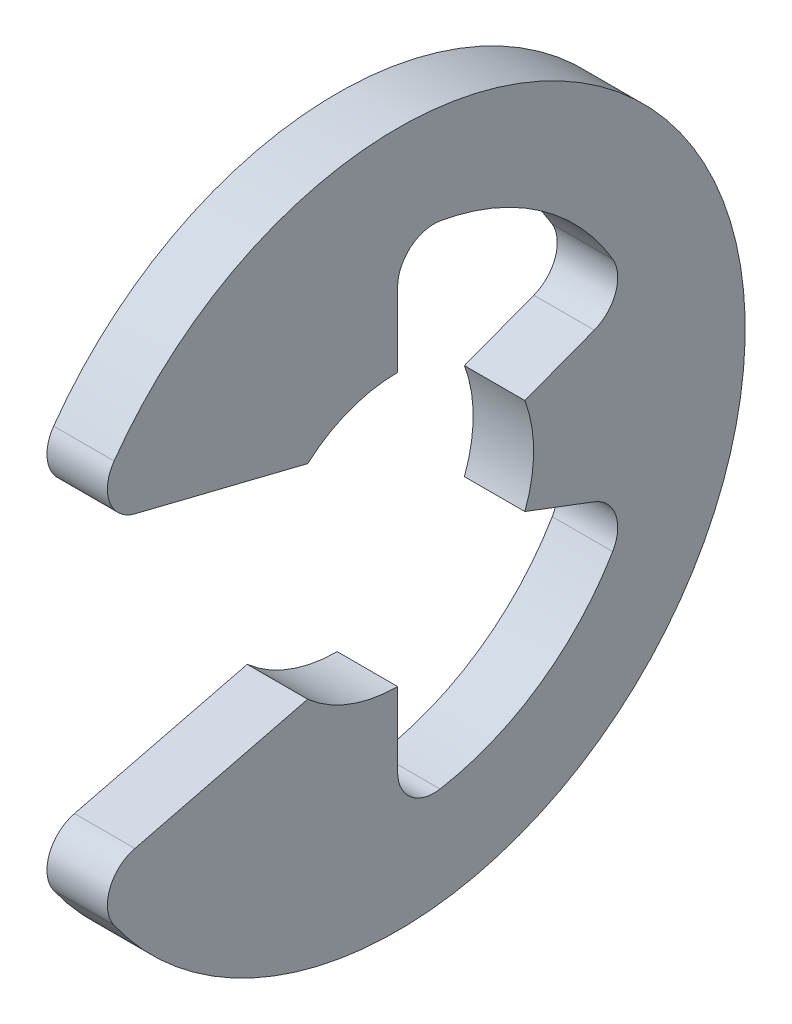
ISO-10303-21;
HEADER;
FILE_DESCRIPTION(('STEP AP214'),'2;1');
FILE_NAME('part.step','',(''),(''),'','','');
FILE_SCHEMA(('AUTOMOTIVE_DESIGN { 1 0 10303 214 1 1 1 1 }'));
ENDSEC;
DATA;
#1=APPLICATION_CONTEXT('core data for automotive mechanical design processes');
#2=APPLICATION_PROTOCOL_DEFINITION('international standard','automotive_design',2000,#1);
#3=PRODUCT_CONTEXT('',#1,'mechanical');
#4=PRODUCT('Part','Part','',(#3));
#5=PRODUCT_RELATED_PRODUCT_CATEGORY('part','',(#4));
#6=PRODUCT_DEFINITION_FORMATION('','',#4);
#7=PRODUCT_DEFINITION_CONTEXT('part definition',#1,'design');
#8=PRODUCT_DEFINITION('design','',#6,#7);
#9=PRODUCT_DEFINITION_SHAPE('','',#8);
#10=(LENGTH_UNIT() NAMED_UNIT(*) SI_UNIT(.MILLI.,.METRE.));
#11=(NAMED_UNIT(*) PLANE_ANGLE_UNIT() SI_UNIT($,.RADIAN.));
#12=(NAMED_UNIT(*) SI_UNIT($,.STERADIAN.) SOLID_ANGLE_UNIT());
#13=UNCERTAINTY_MEASURE_WITH_UNIT(LENGTH_MEASURE(1.E-05),#10,'distance_accuracy_value','');
#14=(GEOMETRIC_REPRESENTATION_CONTEXT(3) GLOBAL_UNCERTAINTY_ASSIGNED_CONTEXT((#13)) GLOBAL_UNIT_ASSIGNED_CONTEXT((#10,
#11,#12)) REPRESENTATION_CONTEXT('',''));
#15=CARTESIAN_POINT('',(0.,0.,0.));
#16=DIRECTION('',(0.,0.,1.));
#17=DIRECTION('',(1.,0.,0.));
#18=AXIS2_PLACEMENT_3D('',#15,#16,#17);
#19=CARTESIAN_POINT('',(0.3,0.,0.));
#20=DIRECTION('',(-1.,0.,0.));
#21=DIRECTION('',(0.,0.,1.));
#22=AXIS2_PLACEMENT_3D('',#19,#20,#21);
#23=CYLINDRICAL_SURFACE('',#22,3.45);
#24=CARTESIAN_POINT('',(0.3,0.,0.));
#25=DIRECTION('',(1.,0.,0.));
#26=DIRECTION('',(0.,0.,-1.));
#27=AXIS2_PLACEMENT_3D('',#24,#25,#26);
#28=CIRCLE('',#27,3.45);
#29=CARTESIAN_POINT('',(0.3,-1.99575242284903,2.8141556933994));
#30=VERTEX_POINT('',#29);
#31=CARTESIAN_POINT('',(0.3,1.99575242284903,2.8141556933994));
#32=VERTEX_POINT('',#31);
#33=EDGE_CURVE('E172',#30,#32,#28,.T.);
#34=ORIENTED_EDGE('',*,*,#33,.F.);
#35=DIRECTION('',(-1.,0.,0.));
#36=VECTOR('',#35,1.);
#37=CARTESIAN_POINT('',(0.3,-1.99575242284903,2.8141556933994));
#38=LINE('',#37,#36);
#39=CARTESIAN_POINT('',(-0.3,-1.99575242284903,2.8141556933994));
#40=VERTEX_POINT('',#39);
#41=EDGE_CURVE('E266',#30,#40,#38,.T.);
#42=ORIENTED_EDGE('',*,*,#41,.T.);
#43=CARTESIAN_POINT('',(-0.3,0.,0.));
#44=DIRECTION('',(1.,0.,0.));
#45=DIRECTION('',(0.,0.,-1.));
#46=AXIS2_PLACEMENT_3D('',#43,#44,#45);
#47=CIRCLE('',#46,3.45);
#48=CARTESIAN_POINT('',(-0.3,1.99575242284903,2.8141556933994));
#49=VERTEX_POINT('',#48);
#50=EDGE_CURVE('E210',#40,#49,#47,.T.);
#51=ORIENTED_EDGE('',*,*,#50,.T.);
#52=DIRECTION('',(-1.,0.,0.));
#53=VECTOR('',#52,1.);
#54=CARTESIAN_POINT('',(0.3,1.99575242284903,2.8141556933994));
#55=LINE('',#54,#53);
#56=EDGE_CURVE('E264',#49,#32,#55,.F.);
#57=ORIENTED_EDGE('',*,*,#56,.T.);
#58=EDGE_LOOP('',(#34,#42,#51,#57));
#59=FACE_BOUND('',#58,.T.);
#60=ADVANCED_FACE('F34',(#59),#23,.T.);
#61=CARTESIAN_POINT('',(0.3,1.55535385551941,3.07950878942095));
#62=DIRECTION('',(0.,0.970536829925373,-0.240952820606871));
#63=DIRECTION('',(0.,0.240952820606871,0.970536829925373));
#64=AXIS2_PLACEMENT_3D('',#61,#62,#63);
#65=PLANE('',#64);
#66=DIRECTION('',(0.,-0.240952820606871,-0.970536829925373));
#67=VECTOR('',#66,1.);
#68=CARTESIAN_POINT('',(0.3,1.55535385551941,3.07950878942095));
#69=LINE('',#68,#67);
#70=CARTESIAN_POINT('',(0.3,1.43810673734382,2.60724767994141));
#71=VERTEX_POINT('',#70);
#72=CARTESIAN_POINT('',(0.3,1.0125,0.8929410674843));
#73=VERTEX_POINT('',#72);
#74=EDGE_CURVE('E158',#71,#73,#69,.T.);
#75=ORIENTED_EDGE('',*,*,#74,.F.);
#76=DIRECTION('',(-1.,0.,0.));
#77=VECTOR('',#76,1.);
#78=CARTESIAN_POINT('',(0.3,1.43810673734382,2.60724767994141));
#79=LINE('',#78,#77);
#80=CARTESIAN_POINT('',(-0.3,1.43810673734382,2.60724767994141));
#81=VERTEX_POINT('',#80);
#82=EDGE_CURVE('E278',#71,#81,#79,.T.);
#83=ORIENTED_EDGE('',*,*,#82,.T.);
#84=DIRECTION('',(0.,-0.240952820606871,-0.970536829925373));
#85=VECTOR('',#84,1.);
#86=CARTESIAN_POINT('',(-0.3,1.55535385551941,3.07950878942095));
#87=LINE('',#86,#85);
#88=CARTESIAN_POINT('',(-0.3,1.0125,0.8929410674843));
#89=VERTEX_POINT('',#88);
#90=EDGE_CURVE('E178',#81,#89,#87,.T.);
#91=ORIENTED_EDGE('',*,*,#90,.T.);
#92=DIRECTION('',(-1.,0.,0.));
#93=VECTOR('',#92,1.);
#94=CARTESIAN_POINT('',(0.3,1.0125,0.8929410674843));
#95=LINE('',#94,#93);
#96=EDGE_CURVE('E175',#73,#89,#95,.T.);
#97=ORIENTED_EDGE('',*,*,#96,.F.);
#98=EDGE_LOOP('',(#75,#83,#91,#97));
#99=FACE_BOUND('',#98,.T.);
#100=ADVANCED_FACE('F176',(#99),#65,.F.);
#101=CARTESIAN_POINT('',(0.3,0.,0.));
#102=DIRECTION('',(-1.,0.,0.));
#103=DIRECTION('',(0.,0.,1.));
#104=AXIS2_PLACEMENT_3D('',#101,#102,#103);
#105=CYLINDRICAL_SURFACE('',#104,1.35);
#106=CARTESIAN_POINT('',(-0.3,0.,0.));
#107=DIRECTION('',(-1.,0.,0.));
#108=DIRECTION('',(0.,0.,1.));
#109=AXIS2_PLACEMENT_3D('',#106,#107,#108);
#110=CIRCLE('',#109,1.35);
#111=CARTESIAN_POINT('',(-0.3,1.35,0.));
#112=VERTEX_POINT('',#111);
#113=EDGE_CURVE('E214',#89,#112,#110,.T.);
#114=ORIENTED_EDGE('',*,*,#113,.T.);
#115=DIRECTION('',(-1.,0.,0.));
#116=VECTOR('',#115,1.);
#117=CARTESIAN_POINT('',(0.3,1.35,0.));
#118=LINE('',#117,#116);
#119=CARTESIAN_POINT('',(0.3,1.35,0.));
#120=VERTEX_POINT('',#119);
#121=EDGE_CURVE('E182',#120,#112,#118,.T.);
#122=ORIENTED_EDGE('',*,*,#121,.F.);
#123=CARTESIAN_POINT('',(0.3,0.,0.));
#124=DIRECTION('',(-1.,0.,0.));
#125=DIRECTION('',(0.,0.,1.));
#126=AXIS2_PLACEMENT_3D('',#123,#124,#125);
#127=CIRCLE('',#126,1.35);
#128=EDGE_CURVE('E164',#73,#120,#127,.T.);
#129=ORIENTED_EDGE('',*,*,#128,.F.);
#130=ORIENTED_EDGE('',*,*,#96,.T.);
#131=EDGE_LOOP('',(#114,#122,#129,#130));
#132=FACE_BOUND('',#131,.T.);
#133=ADVANCED_FACE('F184',(#132),#105,.F.);
#134=CARTESIAN_POINT('',(0.3,1.35,0.));
#135=DIRECTION('',(0.,0.,1.));
#136=DIRECTION('',(0.,-1.,0.));
#137=AXIS2_PLACEMENT_3D('',#134,#135,#136);
#138=PLANE('',#137);
#139=DIRECTION('',(0.,1.,0.));
#140=VECTOR('',#139,1.);
#141=CARTESIAN_POINT('',(-0.3,1.35,0.));
#142=LINE('',#141,#140);
#143=CARTESIAN_POINT('',(-0.3,2.08659165249111,0.));
#144=VERTEX_POINT('',#143);
#145=EDGE_CURVE('E216',#112,#144,#142,.T.);
#146=ORIENTED_EDGE('',*,*,#145,.T.);
#147=DIRECTION('',(1.,0.,0.));
#148=VECTOR('',#147,1.);
#149=CARTESIAN_POINT('',(0.3,2.08659165249111,0.));
#150=LINE('',#149,#148);
#151=CARTESIAN_POINT('',(0.3,2.08659165249111,0.));
#152=VERTEX_POINT('',#151);
#153=EDGE_CURVE('E262',#144,#152,#150,.T.);
#154=ORIENTED_EDGE('',*,*,#153,.T.);
#155=DIRECTION('',(0.,1.,0.));
#156=VECTOR('',#155,1.);
#157=CARTESIAN_POINT('',(0.3,1.35,0.));
#158=LINE('',#157,#156);
#159=EDGE_CURVE('E187',#120,#152,#158,.T.);
#160=ORIENTED_EDGE('',*,*,#159,.F.);
#161=ORIENTED_EDGE('',*,*,#121,.T.);
#162=EDGE_LOOP('',(#146,#154,#160,#161));
#163=FACE_BOUND('',#162,.T.);
#164=ADVANCED_FACE('F384',(#163),#138,.F.);
#165=CARTESIAN_POINT('',(0.3,0.,0.));
#166=DIRECTION('',(-1.,0.,0.));
#167=DIRECTION('',(0.,0.,1.));
#168=AXIS2_PLACEMENT_3D('',#165,#166,#167);
#169=CYLINDRICAL_SURFACE('',#168,2.47741935483871);
#170=CARTESIAN_POINT('',(0.3,0.,0.));
#171=DIRECTION('',(-1.,0.,0.));
#172=DIRECTION('',(0.,0.,-1.));
#173=AXIS2_PLACEMENT_3D('',#170,#171,#172);
#174=CIRCLE('',#173,2.47741935483871);
#175=CARTESIAN_POINT('',(0.3,2.44135037951428,-0.421206581352832));
#176=VERTEX_POINT('',#175);
#177=CARTESIAN_POINT('',(0.3,1.25715038342261,-2.13475515532574));
#178=VERTEX_POINT('',#177);
#179=EDGE_CURVE('E189',#176,#178,#174,.T.);
#180=ORIENTED_EDGE('',*,*,#179,.F.);
#181=DIRECTION('',(-1.,0.,0.));
#182=VECTOR('',#181,1.);
#183=CARTESIAN_POINT('',(0.3,2.44135037951428,-0.421206581352832));
#184=LINE('',#183,#182);
#185=CARTESIAN_POINT('',(-0.3,2.44135037951428,-0.421206581352832));
#186=VERTEX_POINT('',#185);
#187=EDGE_CURVE('E259',#176,#186,#184,.T.);
#188=ORIENTED_EDGE('',*,*,#187,.T.);
#189=CARTESIAN_POINT('',(-0.3,0.,0.));
#190=DIRECTION('',(-1.,0.,0.));
#191=DIRECTION('',(0.,0.,-1.));
#192=AXIS2_PLACEMENT_3D('',#189,#190,#191);
#193=CIRCLE('',#192,2.47741935483871);
#194=CARTESIAN_POINT('',(-0.3,1.25715038342261,-2.13475515532574));
#195=VERTEX_POINT('',#194);
#196=EDGE_CURVE('E219',#186,#195,#193,.T.);
#197=ORIENTED_EDGE('',*,*,#196,.T.);
#198=DIRECTION('',(-1.,0.,0.));
#199=VECTOR('',#198,1.);
#200=CARTESIAN_POINT('',(0.3,1.25715038342261,-2.13475515532574));
#201=LINE('',#200,#199);
#202=EDGE_CURVE('E257',#195,#178,#201,.F.);
#203=ORIENTED_EDGE('',*,*,#202,.T.);
#204=EDGE_LOOP('',(#180,#188,#197,#203));
#205=FACE_BOUND('',#204,.T.);
#206=ADVANCED_FACE('F306',(#205),#169,.F.);
#207=CARTESIAN_POINT('',(0.3,0.477297077300919,-1.26280936803621));
#208=DIRECTION('',(0.,-0.935414346693484,-0.353553390593278));
#209=DIRECTION('',(0.,0.353553390593278,-0.935414346693484));
#210=AXIS2_PLACEMENT_3D('',#207,#208,#209);
#211=PLANE('',#210);
#212=DIRECTION('',(0.,-0.353553390593278,0.935414346693484));
#213=VECTOR('',#212,1.);
#214=CARTESIAN_POINT('',(0.3,0.477297077300919,-1.26280936803621));
#215=LINE('',#214,#213);
#216=CARTESIAN_POINT('',(0.3,0.737721553521856,-1.95182776743105));
#217=VERTEX_POINT('',#216);
#218=CARTESIAN_POINT('',(0.3,0.477297077300919,-1.26280936803621));
#219=VERTEX_POINT('',#218);
#220=EDGE_CURVE('E194',#217,#219,#215,.T.);
#221=ORIENTED_EDGE('',*,*,#220,.F.);
#222=DIRECTION('',(1.,0.,0.));
#223=VECTOR('',#222,1.);
#224=CARTESIAN_POINT('',(-0.3,0.737721553521856,-1.95182776743105));
#225=LINE('',#224,#223);
#226=CARTESIAN_POINT('',(-0.3,0.737721553521856,-1.95182776743105));
#227=VERTEX_POINT('',#226);
#228=EDGE_CURVE('E281',#217,#227,#225,.F.);
#229=ORIENTED_EDGE('',*,*,#228,.T.);
#230=DIRECTION('',(0.,-0.353553390593278,0.935414346693484));
#231=VECTOR('',#230,1.);
#232=CARTESIAN_POINT('',(-0.3,0.477297077300919,-1.26280936803621));
#233=LINE('',#232,#231);
#234=CARTESIAN_POINT('',(-0.3,0.477297077300919,-1.26280936803621));
#235=VERTEX_POINT('',#234);
#236=EDGE_CURVE('E222',#227,#235,#233,.T.);
#237=ORIENTED_EDGE('',*,*,#236,.T.);
#238=DIRECTION('',(-1.,0.,0.));
#239=VECTOR('',#238,1.);
#240=CARTESIAN_POINT('',(0.3,0.477297077300919,-1.26280936803621));
#241=LINE('',#240,#239);
#242=EDGE_CURVE('E246',#219,#235,#241,.T.);
#243=ORIENTED_EDGE('',*,*,#242,.F.);
#244=EDGE_LOOP('',(#221,#229,#237,#243));
#245=FACE_BOUND('',#244,.T.);
#246=ADVANCED_FACE('F309',(#245),#211,.F.);
#247=CARTESIAN_POINT('',(0.3,0.,0.));
#248=DIRECTION('',(-1.,0.,0.));
#249=DIRECTION('',(0.,0.,1.));
#250=AXIS2_PLACEMENT_3D('',#247,#248,#249);
#251=CYLINDRICAL_SURFACE('',#250,1.35);
#252=CARTESIAN_POINT('',(-0.3,0.,0.));
#253=DIRECTION('',(-1.,0.,0.));
#254=DIRECTION('',(0.,0.,1.));
#255=AXIS2_PLACEMENT_3D('',#252,#253,#254);
#256=CIRCLE('',#255,1.35);
#257=CARTESIAN_POINT('',(-0.3,-0.477297077300919,-1.26280936803621));
#258=VERTEX_POINT('',#257);
#259=EDGE_CURVE('E224',#235,#258,#256,.T.);
#260=ORIENTED_EDGE('',*,*,#259,.T.);
#261=DIRECTION('',(-1.,0.,0.));
#262=VECTOR('',#261,1.);
#263=CARTESIAN_POINT('',(0.3,-0.477297077300919,-1.26280936803621));
#264=LINE('',#263,#262);
#265=CARTESIAN_POINT('',(0.3,-0.477297077300919,-1.26280936803621));
#266=VERTEX_POINT('',#265);
#267=EDGE_CURVE('E243',#266,#258,#264,.T.);
#268=ORIENTED_EDGE('',*,*,#267,.F.);
#269=CARTESIAN_POINT('',(0.3,0.,0.));
#270=DIRECTION('',(-1.,0.,0.));
#271=DIRECTION('',(0.,0.,1.));
#272=AXIS2_PLACEMENT_3D('',#269,#270,#271);
#273=CIRCLE('',#272,1.35);
#274=EDGE_CURVE('E196',#219,#266,#273,.T.);
#275=ORIENTED_EDGE('',*,*,#274,.F.);
#276=ORIENTED_EDGE('',*,*,#242,.T.);
#277=EDGE_LOOP('',(#260,#268,#275,#276));
#278=FACE_BOUND('',#277,.T.);
#279=ADVANCED_FACE('F315',(#278),#251,.F.);
#280=CARTESIAN_POINT('',(0.3,-0.477297077300919,-1.26280936803621));
#281=DIRECTION('',(0.,0.935414346693484,-0.353553390593277));
#282=DIRECTION('',(0.,0.353553390593277,0.935414346693484));
#283=AXIS2_PLACEMENT_3D('',#280,#281,#282);
#284=PLANE('',#283);
#285=DIRECTION('',(0.,-0.353553390593277,-0.935414346693484));
#286=VECTOR('',#285,1.);
#287=CARTESIAN_POINT('',(-0.3,-0.477297077300919,-1.26280936803621));
#288=LINE('',#287,#286);
#289=CARTESIAN_POINT('',(-0.3,-0.737721553521855,-1.95182776743105));
#290=VERTEX_POINT('',#289);
#291=EDGE_CURVE('E226',#258,#290,#288,.T.);
#292=ORIENTED_EDGE('',*,*,#291,.T.);
#293=DIRECTION('',(1.,0.,0.));
#294=VECTOR('',#293,1.);
#295=CARTESIAN_POINT('',(0.3,-0.737721553521855,-1.95182776743105));
#296=LINE('',#295,#294);
#297=CARTESIAN_POINT('',(0.3,-0.737721553521855,-1.95182776743105));
#298=VERTEX_POINT('',#297);
#299=EDGE_CURVE('E49',#290,#298,#296,.T.);
#300=ORIENTED_EDGE('',*,*,#299,.T.);
#301=DIRECTION('',(0.,-0.353553390593277,-0.935414346693484));
#302=VECTOR('',#301,1.);
#303=CARTESIAN_POINT('',(0.3,-0.477297077300919,-1.26280936803621));
#304=LINE('',#303,#302);
#305=EDGE_CURVE('E198',#266,#298,#304,.T.);
#306=ORIENTED_EDGE('',*,*,#305,.F.);
#307=ORIENTED_EDGE('',*,*,#267,.T.);
#308=EDGE_LOOP('',(#292,#300,#306,#307));
#309=FACE_BOUND('',#308,.T.);
#310=ADVANCED_FACE('F317',(#309),#284,.F.);
#311=CARTESIAN_POINT('',(0.3,0.,0.));
#312=DIRECTION('',(-1.,0.,0.));
#313=DIRECTION('',(0.,0.,1.));
#314=AXIS2_PLACEMENT_3D('',#311,#312,#313);
#315=CYLINDRICAL_SURFACE('',#314,2.47741935483871);
#316=CARTESIAN_POINT('',(-0.3,0.,0.));
#317=DIRECTION('',(-1.,0.,0.));
#318=DIRECTION('',(0.,0.,-1.));
#319=AXIS2_PLACEMENT_3D('',#316,#317,#318);
#320=CIRCLE('',#319,2.47741935483871);
#321=CARTESIAN_POINT('',(-0.3,-1.25715038342261,-2.13475515532574));
#322=VERTEX_POINT('',#321);
#323=CARTESIAN_POINT('',(-0.3,-2.44135037951428,-0.421206581352832));
#324=VERTEX_POINT('',#323);
#325=EDGE_CURVE('E228',#322,#324,#320,.T.);
#326=ORIENTED_EDGE('',*,*,#325,.T.);
#327=DIRECTION('',(-1.,0.,0.));
#328=VECTOR('',#327,1.);
#329=CARTESIAN_POINT('',(0.3,-2.44135037951428,-0.421206581352832));
#330=LINE('',#329,#328);
#331=CARTESIAN_POINT('',(0.3,-2.44135037951428,-0.421206581352832));
#332=VERTEX_POINT('',#331);
#333=EDGE_CURVE('E255',#324,#332,#330,.F.);
#334=ORIENTED_EDGE('',*,*,#333,.T.);
#335=CARTESIAN_POINT('',(0.3,0.,0.));
#336=DIRECTION('',(-1.,0.,0.));
#337=DIRECTION('',(0.,0.,-1.));
#338=AXIS2_PLACEMENT_3D('',#335,#336,#337);
#339=CIRCLE('',#338,2.47741935483871);
#340=CARTESIAN_POINT('',(0.3,-1.25715038342261,-2.13475515532574));
#341=VERTEX_POINT('',#340);
#342=EDGE_CURVE('E200',#341,#332,#339,.T.);
#343=ORIENTED_EDGE('',*,*,#342,.F.);
#344=DIRECTION('',(-1.,0.,0.));
#345=VECTOR('',#344,1.);
#346=CARTESIAN_POINT('',(0.3,-1.25715038342261,-2.13475515532574));
#347=LINE('',#346,#345);
#348=EDGE_CURVE('E252',#341,#322,#347,.T.);
#349=ORIENTED_EDGE('',*,*,#348,.T.);
#350=EDGE_LOOP('',(#326,#334,#343,#349));
#351=FACE_BOUND('',#350,.T.);
#352=ADVANCED_FACE('F319',(#351),#315,.F.);
#353=CARTESIAN_POINT('',(0.3,-1.35,0.));
#354=DIRECTION('',(0.,0.,1.));
#355=DIRECTION('',(0.,-1.,0.));
#356=AXIS2_PLACEMENT_3D('',#353,#354,#355);
#357=PLANE('',#356);
#358=DIRECTION('',(0.,1.,0.));
#359=VECTOR('',#358,1.);
#360=CARTESIAN_POINT('',(0.3,-1.35,0.));
#361=LINE('',#360,#359);
#362=CARTESIAN_POINT('',(0.3,-2.08659165249111,0.));
#363=VERTEX_POINT('',#362);
#364=CARTESIAN_POINT('',(0.3,-1.35,0.));
#365=VERTEX_POINT('',#364);
#366=EDGE_CURVE('E203',#363,#365,#361,.T.);
#367=ORIENTED_EDGE('',*,*,#366,.F.);
#368=DIRECTION('',(1.,0.,0.));
#369=VECTOR('',#368,1.);
#370=CARTESIAN_POINT('',(-0.3,-2.08659165249111,0.));
#371=LINE('',#370,#369);
#372=CARTESIAN_POINT('',(-0.3,-2.08659165249111,0.));
#373=VERTEX_POINT('',#372);
#374=EDGE_CURVE('E181',#363,#373,#371,.F.);
#375=ORIENTED_EDGE('',*,*,#374,.T.);
#376=DIRECTION('',(0.,1.,0.));
#377=VECTOR('',#376,1.);
#378=CARTESIAN_POINT('',(-0.3,-1.35,0.));
#379=LINE('',#378,#377);
#380=CARTESIAN_POINT('',(-0.3,-1.35,0.));
#381=VERTEX_POINT('',#380);
#382=EDGE_CURVE('E231',#373,#381,#379,.T.);
#383=ORIENTED_EDGE('',*,*,#382,.T.);
#384=DIRECTION('',(-1.,0.,0.));
#385=VECTOR('',#384,1.);
#386=CARTESIAN_POINT('',(0.3,-1.35,0.));
#387=LINE('',#386,#385);
#388=EDGE_CURVE('E240',#365,#381,#387,.T.);
#389=ORIENTED_EDGE('',*,*,#388,.F.);
#390=EDGE_LOOP('',(#367,#375,#383,#389));
#391=FACE_BOUND('',#390,.T.);
#392=ADVANCED_FACE('F325',(#391),#357,.F.);
#393=CARTESIAN_POINT('',(0.3,0.,0.));
#394=DIRECTION('',(-1.,0.,0.));
#395=DIRECTION('',(0.,0.,1.));
#396=AXIS2_PLACEMENT_3D('',#393,#394,#395);
#397=CYLINDRICAL_SURFACE('',#396,1.35);
#398=CARTESIAN_POINT('',(-0.3,0.,0.));
#399=DIRECTION('',(-1.,0.,0.));
#400=DIRECTION('',(0.,0.,-1.));
#401=AXIS2_PLACEMENT_3D('',#398,#399,#400);
#402=CIRCLE('',#401,1.35);
#403=CARTESIAN_POINT('',(-0.3,-1.0125,0.8929410674843));
#404=VERTEX_POINT('',#403);
#405=EDGE_CURVE('E233',#381,#404,#402,.T.);
#406=ORIENTED_EDGE('',*,*,#405,.T.);
#407=DIRECTION('',(-1.,0.,0.));
#408=VECTOR('',#407,1.);
#409=CARTESIAN_POINT('',(0.3,-1.0125,0.8929410674843));
#410=LINE('',#409,#408);
#411=CARTESIAN_POINT('',(0.3,-1.0125,0.8929410674843));
#412=VERTEX_POINT('',#411);
#413=EDGE_CURVE('E209',#412,#404,#410,.T.);
#414=ORIENTED_EDGE('',*,*,#413,.F.);
#415=CARTESIAN_POINT('',(0.3,0.,0.));
#416=DIRECTION('',(-1.,0.,0.));
#417=DIRECTION('',(0.,0.,-1.));
#418=AXIS2_PLACEMENT_3D('',#415,#416,#417);
#419=CIRCLE('',#418,1.35);
#420=EDGE_CURVE('E205',#365,#412,#419,.T.);
#421=ORIENTED_EDGE('',*,*,#420,.F.);
#422=ORIENTED_EDGE('',*,*,#388,.T.);
#423=EDGE_LOOP('',(#406,#414,#421,#422));
#424=FACE_BOUND('',#423,.T.);
#425=ADVANCED_FACE('F374',(#424),#397,.F.);
#426=CARTESIAN_POINT('',(0.3,-1.55535385551941,3.07950878942095));
#427=DIRECTION('',(0.,-0.970536829925373,-0.240952820606872));
#428=DIRECTION('',(0.,0.240952820606872,-0.970536829925373));
#429=AXIS2_PLACEMENT_3D('',#426,#427,#428);
#430=PLANE('',#429);
#431=DIRECTION('',(0.,-0.240952820606872,0.970536829925373));
#432=VECTOR('',#431,1.);
#433=CARTESIAN_POINT('',(-0.3,-1.55535385551941,3.07950878942095));
#434=LINE('',#433,#432);
#435=CARTESIAN_POINT('',(-0.3,-1.43810673734382,2.60724767994141));
#436=VERTEX_POINT('',#435);
#437=EDGE_CURVE('E235',#404,#436,#434,.T.);
#438=ORIENTED_EDGE('',*,*,#437,.T.);
#439=DIRECTION('',(-1.,0.,0.));
#440=VECTOR('',#439,1.);
#441=CARTESIAN_POINT('',(0.3,-1.43810673734382,2.60724767994141));
#442=LINE('',#441,#440);
#443=CARTESIAN_POINT('',(0.3,-1.43810673734382,2.60724767994141));
#444=VERTEX_POINT('',#443);
#445=EDGE_CURVE('E273',#436,#444,#442,.F.);
#446=ORIENTED_EDGE('',*,*,#445,.T.);
#447=DIRECTION('',(0.,-0.240952820606872,0.970536829925373));
#448=VECTOR('',#447,1.);
#449=CARTESIAN_POINT('',(0.3,-1.55535385551941,3.07950878942095));
#450=LINE('',#449,#448);
#451=EDGE_CURVE('E207',#412,#444,#450,.T.);
#452=ORIENTED_EDGE('',*,*,#451,.F.);
#453=ORIENTED_EDGE('',*,*,#413,.T.);
#454=EDGE_LOOP('',(#438,#446,#452,#453));
#455=FACE_BOUND('',#454,.T.);
#456=ADVANCED_FACE('F416',(#455),#430,.F.);
#457=CARTESIAN_POINT('',(0.3,0.,0.));
#458=DIRECTION('',(1.,0.,0.));
#459=DIRECTION('',(0.,0.,-1.));
#460=AXIS2_PLACEMENT_3D('',#457,#458,#459);
#461=PLANE('',#460);
#462=ORIENTED_EDGE('',*,*,#451,.T.);
#463=CARTESIAN_POINT('',(0.3,-1.78749999611696,2.52050466452294));
#464=DIRECTION('',(1.,0.,0.));
#465=DIRECTION('',(0.,0.,-1.));
#466=AXIS2_PLACEMENT_3D('',#463,#464,#465);
#467=CIRCLE('',#466,0.36);
#468=EDGE_CURVE('E276',#444,#30,#467,.T.);
#469=ORIENTED_EDGE('',*,*,#468,.T.);
#470=ORIENTED_EDGE('',*,*,#33,.T.);
#471=CARTESIAN_POINT('',(0.3,1.78749999611695,2.52050466452294));
#472=DIRECTION('',(1.,0.,0.));
#473=DIRECTION('',(0.,0.,-1.));
#474=AXIS2_PLACEMENT_3D('',#471,#472,#473);
#475=CIRCLE('',#474,0.36);
#476=EDGE_CURVE('E168',#32,#71,#475,.T.);
#477=ORIENTED_EDGE('',*,*,#476,.T.);
#478=ORIENTED_EDGE('',*,*,#74,.T.);
#479=ORIENTED_EDGE('',*,*,#128,.T.);
#480=ORIENTED_EDGE('',*,*,#159,.T.);
#481=CARTESIAN_POINT('',(0.3,2.08659165249111,-0.359999999999998));
#482=DIRECTION('',(1.,0.,0.));
#483=DIRECTION('',(0.,0.,-1.));
#484=AXIS2_PLACEMENT_3D('',#481,#482,#483);
#485=CIRCLE('',#484,0.36);
#486=EDGE_CURVE('E290',#152,#176,#485,.F.);
#487=ORIENTED_EDGE('',*,*,#486,.T.);
#488=ORIENTED_EDGE('',*,*,#179,.T.);
#489=CARTESIAN_POINT('',(0.3,1.07447071833151,-1.82454854681747));
#490=DIRECTION('',(1.,0.,0.));
#491=DIRECTION('',(0.,0.,-1.));
#492=AXIS2_PLACEMENT_3D('',#489,#490,#491);
#493=CIRCLE('',#492,0.36);
#494=EDGE_CURVE('E11',#178,#217,#493,.F.);
#495=ORIENTED_EDGE('',*,*,#494,.T.);
#496=ORIENTED_EDGE('',*,*,#220,.T.);
#497=ORIENTED_EDGE('',*,*,#274,.T.);
#498=ORIENTED_EDGE('',*,*,#305,.T.);
#499=CARTESIAN_POINT('',(0.3,-1.07447071833151,-1.82454854681747));
#500=DIRECTION('',(1.,0.,0.));
#501=DIRECTION('',(0.,0.,-1.));
#502=AXIS2_PLACEMENT_3D('',#499,#500,#501);
#503=CIRCLE('',#502,0.36);
#504=EDGE_CURVE('E294',#298,#341,#503,.F.);
#505=ORIENTED_EDGE('',*,*,#504,.T.);
#506=ORIENTED_EDGE('',*,*,#342,.T.);
#507=CARTESIAN_POINT('',(0.3,-2.08659165249111,-0.359999999999999));
#508=DIRECTION('',(1.,0.,0.));
#509=DIRECTION('',(0.,0.,-1.));
#510=AXIS2_PLACEMENT_3D('',#507,#508,#509);
#511=CIRCLE('',#510,0.36);
#512=EDGE_CURVE('E286',#332,#363,#511,.F.);
#513=ORIENTED_EDGE('',*,*,#512,.T.);
#514=ORIENTED_EDGE('',*,*,#366,.T.);
#515=ORIENTED_EDGE('',*,*,#420,.T.);
#516=EDGE_LOOP('',(#462,#469,#470,#477,#478,#479,#480,#487,#488,#495,#496,#497,#498,#505,#506,
#513,#514,#515));
#517=FACE_BOUND('',#516,.T.);
#518=ADVANCED_FACE('F161',(#517),#461,.T.);
#519=CARTESIAN_POINT('',(-0.3,0.,0.));
#520=DIRECTION('',(1.,0.,0.));
#521=DIRECTION('',(0.,0.,-1.));
#522=AXIS2_PLACEMENT_3D('',#519,#520,#521);
#523=PLANE('',#522);
#524=ORIENTED_EDGE('',*,*,#50,.F.);
#525=CARTESIAN_POINT('',(-0.3,-1.78749999611696,2.52050466452294));
#526=DIRECTION('',(1.,0.,0.));
#527=DIRECTION('',(0.,0.,-1.));
#528=AXIS2_PLACEMENT_3D('',#525,#526,#527);
#529=CIRCLE('',#528,0.36);
#530=EDGE_CURVE('E271',#40,#436,#529,.F.);
#531=ORIENTED_EDGE('',*,*,#530,.T.);
#532=ORIENTED_EDGE('',*,*,#437,.F.);
#533=ORIENTED_EDGE('',*,*,#405,.F.);
#534=ORIENTED_EDGE('',*,*,#382,.F.);
#535=CARTESIAN_POINT('',(-0.3,-2.08659165249111,-0.359999999999999));
#536=DIRECTION('',(1.,0.,0.));
#537=DIRECTION('',(0.,0.,-1.));
#538=AXIS2_PLACEMENT_3D('',#535,#536,#537);
#539=CIRCLE('',#538,0.36);
#540=EDGE_CURVE('E284',#373,#324,#539,.T.);
#541=ORIENTED_EDGE('',*,*,#540,.T.);
#542=ORIENTED_EDGE('',*,*,#325,.F.);
#543=CARTESIAN_POINT('',(-0.3,-1.07447071833151,-1.82454854681747));
#544=DIRECTION('',(1.,0.,0.));
#545=DIRECTION('',(0.,0.,-1.));
#546=AXIS2_PLACEMENT_3D('',#543,#544,#545);
#547=CIRCLE('',#546,0.36);
#548=EDGE_CURVE('E292',#322,#290,#547,.T.);
#549=ORIENTED_EDGE('',*,*,#548,.T.);
#550=ORIENTED_EDGE('',*,*,#291,.F.);
#551=ORIENTED_EDGE('',*,*,#259,.F.);
#552=ORIENTED_EDGE('',*,*,#236,.F.);
#553=CARTESIAN_POINT('',(-0.3,1.07447071833151,-1.82454854681747));
#554=DIRECTION('',(1.,0.,0.));
#555=DIRECTION('',(0.,0.,-1.));
#556=AXIS2_PLACEMENT_3D('',#553,#554,#555);
#557=CIRCLE('',#556,0.36);
#558=EDGE_CURVE('E42',#227,#195,#557,.T.);
#559=ORIENTED_EDGE('',*,*,#558,.T.);
#560=ORIENTED_EDGE('',*,*,#196,.F.);
#561=CARTESIAN_POINT('',(-0.3,2.08659165249111,-0.359999999999998));
#562=DIRECTION('',(1.,0.,0.));
#563=DIRECTION('',(0.,0.,-1.));
#564=AXIS2_PLACEMENT_3D('',#561,#562,#563);
#565=CIRCLE('',#564,0.36);
#566=EDGE_CURVE('E288',#186,#144,#565,.T.);
#567=ORIENTED_EDGE('',*,*,#566,.T.);
#568=ORIENTED_EDGE('',*,*,#145,.F.);
#569=ORIENTED_EDGE('',*,*,#113,.F.);
#570=ORIENTED_EDGE('',*,*,#90,.F.);
#571=CARTESIAN_POINT('',(-0.3,1.78749999611695,2.52050466452294));
#572=DIRECTION('',(1.,0.,0.));
#573=DIRECTION('',(0.,0.,-1.));
#574=AXIS2_PLACEMENT_3D('',#571,#572,#573);
#575=CIRCLE('',#574,0.36);
#576=EDGE_CURVE('E269',#81,#49,#575,.F.);
#577=ORIENTED_EDGE('',*,*,#576,.T.);
#578=EDGE_LOOP('',(#524,#531,#532,#533,#534,#541,#542,#549,#550,#551,#552,#559,#560,#567,#568,
#569,#570,#577));
#579=FACE_BOUND('',#578,.T.);
#580=ADVANCED_FACE('F299',(#579),#523,.F.);
#581=CARTESIAN_POINT('',(0.3,-2.08659165249111,-0.359999999999999));
#582=DIRECTION('',(-1.,0.,0.));
#583=DIRECTION('',(0.,0.,1.));
#584=AXIS2_PLACEMENT_3D('',#581,#582,#583);
#585=CYLINDRICAL_SURFACE('',#584,0.36);
#586=ORIENTED_EDGE('',*,*,#512,.F.);
#587=ORIENTED_EDGE('',*,*,#333,.F.);
#588=ORIENTED_EDGE('',*,*,#540,.F.);
#589=ORIENTED_EDGE('',*,*,#374,.F.);
#590=EDGE_LOOP('',(#586,#587,#588,#589));
#591=FACE_BOUND('',#590,.T.);
#592=ADVANCED_FACE('F339',(#591),#585,.F.);
#593=CARTESIAN_POINT('',(0.3,2.08659165249111,-0.359999999999998));
#594=DIRECTION('',(-1.,0.,0.));
#595=DIRECTION('',(0.,0.,1.));
#596=AXIS2_PLACEMENT_3D('',#593,#594,#595);
#597=CYLINDRICAL_SURFACE('',#596,0.36);
#598=ORIENTED_EDGE('',*,*,#486,.F.);
#599=ORIENTED_EDGE('',*,*,#153,.F.);
#600=ORIENTED_EDGE('',*,*,#566,.F.);
#601=ORIENTED_EDGE('',*,*,#187,.F.);
#602=EDGE_LOOP('',(#598,#599,#600,#601));
#603=FACE_BOUND('',#602,.T.);
#604=ADVANCED_FACE('F342',(#603),#597,.F.);
#605=CARTESIAN_POINT('',(0.3,-1.78749999611696,2.52050466452294));
#606=DIRECTION('',(-1.,0.,0.));
#607=DIRECTION('',(0.,0.,1.));
#608=AXIS2_PLACEMENT_3D('',#605,#606,#607);
#609=CYLINDRICAL_SURFACE('',#608,0.36);
#610=ORIENTED_EDGE('',*,*,#468,.F.);
#611=ORIENTED_EDGE('',*,*,#445,.F.);
#612=ORIENTED_EDGE('',*,*,#530,.F.);
#613=ORIENTED_EDGE('',*,*,#41,.F.);
#614=EDGE_LOOP('',(#610,#611,#612,#613));
#615=FACE_BOUND('',#614,.T.);
#616=ADVANCED_FACE('F346',(#615),#609,.T.);
#617=CARTESIAN_POINT('',(0.3,1.78749999611695,2.52050466452294));
#618=DIRECTION('',(-1.,0.,0.));
#619=DIRECTION('',(0.,0.,1.));
#620=AXIS2_PLACEMENT_3D('',#617,#618,#619);
#621=CYLINDRICAL_SURFACE('',#620,0.36);
#622=ORIENTED_EDGE('',*,*,#476,.F.);
#623=ORIENTED_EDGE('',*,*,#56,.F.);
#624=ORIENTED_EDGE('',*,*,#576,.F.);
#625=ORIENTED_EDGE('',*,*,#82,.F.);
#626=EDGE_LOOP('',(#622,#623,#624,#625));
#627=FACE_BOUND('',#626,.T.);
#628=ADVANCED_FACE('F350',(#627),#621,.T.);
#629=CARTESIAN_POINT('',(0.3,-1.07447071833151,-1.82454854681747));
#630=DIRECTION('',(-1.,0.,0.));
#631=DIRECTION('',(0.,0.,1.));
#632=AXIS2_PLACEMENT_3D('',#629,#630,#631);
#633=CYLINDRICAL_SURFACE('',#632,0.36);
#634=ORIENTED_EDGE('',*,*,#504,.F.);
#635=ORIENTED_EDGE('',*,*,#299,.F.);
#636=ORIENTED_EDGE('',*,*,#548,.F.);
#637=ORIENTED_EDGE('',*,*,#348,.F.);
#638=EDGE_LOOP('',(#634,#635,#636,#637));
#639=FACE_BOUND('',#638,.T.);
#640=ADVANCED_FACE('F353',(#639),#633,.F.);
#641=CARTESIAN_POINT('',(0.3,1.07447071833151,-1.82454854681747));
#642=DIRECTION('',(-1.,0.,0.));
#643=DIRECTION('',(0.,0.,1.));
#644=AXIS2_PLACEMENT_3D('',#641,#642,#643);
#645=CYLINDRICAL_SURFACE('',#644,0.36);
#646=ORIENTED_EDGE('',*,*,#494,.F.);
#647=ORIENTED_EDGE('',*,*,#202,.F.);
#648=ORIENTED_EDGE('',*,*,#558,.F.);
#649=ORIENTED_EDGE('',*,*,#228,.F.);
#650=EDGE_LOOP('',(#646,#647,#648,#649));
#651=FACE_BOUND('',#650,.T.);
#652=ADVANCED_FACE('F36',(#651),#645,.F.);
#653=CLOSED_SHELL('',(#60,#100,#133,#164,#206,#246,#279,#310,#352,#392,#425,#456,#518,#580,#592,
#604,#616,#628,#640,#652));
#654=MANIFOLD_SOLID_BREP('B2',#653);
#655=ADVANCED_BREP_SHAPE_REPRESENTATION('',(#18,#654),#14);
#656=SHAPE_DEFINITION_REPRESENTATION(#9,#655);
ENDSEC;
END-ISO-10303-21;
